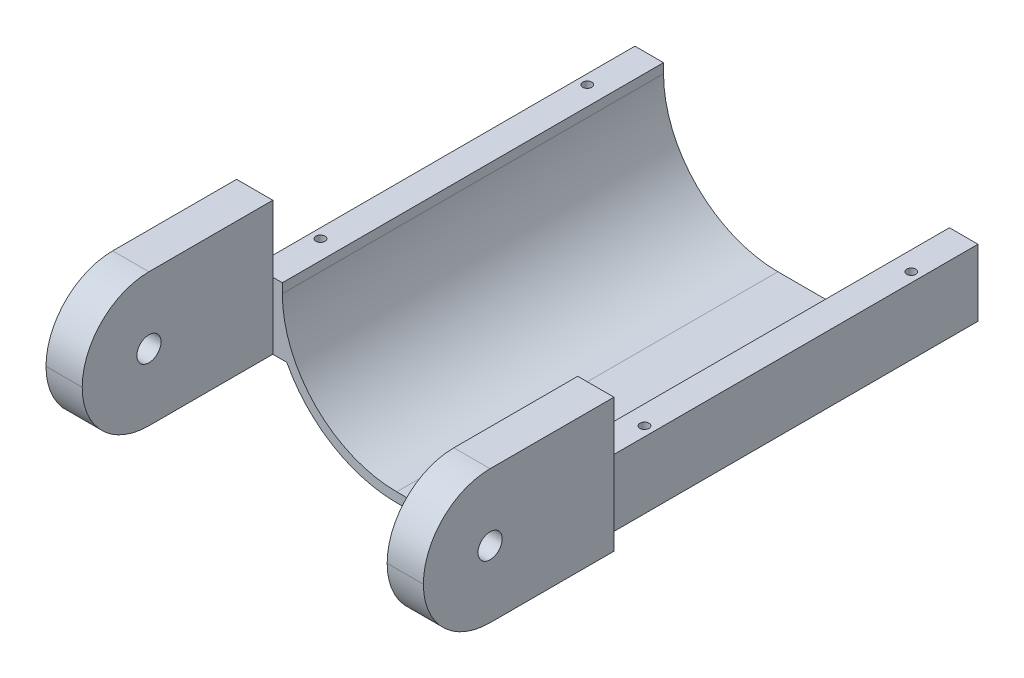
ISO-10303-21;
HEADER;
FILE_DESCRIPTION(('STEP AP214'),'2;1');
FILE_NAME('part.step','',(''),(''),'','','');
FILE_SCHEMA(('AUTOMOTIVE_DESIGN { 1 0 10303 214 1 1 1 1 }'));
ENDSEC;
DATA;
#1=APPLICATION_CONTEXT('core data for automotive mechanical design processes');
#2=APPLICATION_PROTOCOL_DEFINITION('international standard','automotive_design',2000,#1);
#3=PRODUCT_CONTEXT('',#1,'mechanical');
#4=PRODUCT('Part','Part','',(#3));
#5=PRODUCT_RELATED_PRODUCT_CATEGORY('part','',(#4));
#6=PRODUCT_DEFINITION_FORMATION('','',#4);
#7=PRODUCT_DEFINITION_CONTEXT('part definition',#1,'design');
#8=PRODUCT_DEFINITION('design','',#6,#7);
#9=PRODUCT_DEFINITION_SHAPE('','',#8);
#10=(LENGTH_UNIT() NAMED_UNIT(*) SI_UNIT(.MILLI.,.METRE.));
#11=(NAMED_UNIT(*) PLANE_ANGLE_UNIT() SI_UNIT($,.RADIAN.));
#12=(NAMED_UNIT(*) SI_UNIT($,.STERADIAN.) SOLID_ANGLE_UNIT());
#13=UNCERTAINTY_MEASURE_WITH_UNIT(LENGTH_MEASURE(1.E-05),#10,'distance_accuracy_value','');
#14=(GEOMETRIC_REPRESENTATION_CONTEXT(3) GLOBAL_UNCERTAINTY_ASSIGNED_CONTEXT((#13)) GLOBAL_UNIT_ASSIGNED_CONTEXT((#10,
#11,#12)) REPRESENTATION_CONTEXT('',''));
#15=CARTESIAN_POINT('',(0.,0.,0.));
#16=DIRECTION('',(0.,0.,1.));
#17=DIRECTION('',(1.,0.,0.));
#18=AXIS2_PLACEMENT_3D('',#15,#16,#17);
#19=CARTESIAN_POINT('',(0.,0.,300.));
#20=DIRECTION('',(0.,0.,1.));
#21=DIRECTION('',(1.,0.,0.));
#22=AXIS2_PLACEMENT_3D('',#19,#20,#21);
#23=PLANE('',#22);
#24=DIRECTION('',(1.,0.,0.));
#25=VECTOR('',#24,1.);
#26=CARTESIAN_POINT('',(-105.,64.9900000000004,300.));
#27=LINE('',#26,#25);
#28=CARTESIAN_POINT('',(-5.,64.9900000000007,300.));
#29=VERTEX_POINT('',#28);
#30=CARTESIAN_POINT('',(-24.,64.9900000000007,300.));
#31=VERTEX_POINT('',#30);
#32=EDGE_CURVE('E410',#29,#31,#27,.F.);
#33=ORIENTED_EDGE('',*,*,#32,.F.);
#34=DIRECTION('',(0.,-1.,0.));
#35=VECTOR('',#34,1.);
#36=CARTESIAN_POINT('',(-5.,0.,300.));
#37=LINE('',#36,#35);
#38=CARTESIAN_POINT('',(-5.,65.0100000000002,300.));
#39=VERTEX_POINT('',#38);
#40=EDGE_CURVE('E653',#39,#29,#37,.T.);
#41=ORIENTED_EDGE('',*,*,#40,.F.);
#42=DIRECTION('',(1.,0.,0.));
#43=VECTOR('',#42,1.);
#44=CARTESIAN_POINT('',(-105.,65.0100000000004,300.));
#45=LINE('',#44,#43);
#46=CARTESIAN_POINT('',(-24.,65.0100000000004,300.));
#47=VERTEX_POINT('',#46);
#48=EDGE_CURVE('E413',#39,#47,#45,.F.);
#49=ORIENTED_EDGE('',*,*,#48,.T.);
#50=DIRECTION('',(0.,1.,0.));
#51=VECTOR('',#50,1.);
#52=CARTESIAN_POINT('',(-24.,0.,300.));
#53=LINE('',#52,#51);
#54=EDGE_CURVE('E485',#31,#47,#53,.T.);
#55=ORIENTED_EDGE('',*,*,#54,.F.);
#56=EDGE_LOOP('',(#33,#41,#49,#55));
#57=FACE_BOUND('',#56,.T.);
#58=ADVANCED_FACE('F66',(#57),#23,.T.);
#59=CARTESIAN_POINT('',(0.,0.,200.));
#60=DIRECTION('',(0.,0.,1.));
#61=DIRECTION('',(1.,0.,0.));
#62=AXIS2_PLACEMENT_3D('',#59,#60,#61);
#63=PLANE('',#62);
#64=DIRECTION('',(0.,1.,0.));
#65=VECTOR('',#64,1.);
#66=CARTESIAN_POINT('',(-5.,0.,200.));
#67=LINE('',#66,#65);
#68=CARTESIAN_POINT('',(-5.,65.,200.));
#69=VERTEX_POINT('',#68);
#70=CARTESIAN_POINT('',(-5.,100.,200.));
#71=VERTEX_POINT('',#70);
#72=EDGE_CURVE('E247',#69,#71,#67,.T.);
#73=ORIENTED_EDGE('',*,*,#72,.F.);
#74=DIRECTION('',(-1.,0.,0.));
#75=VECTOR('',#74,1.);
#76=CARTESIAN_POINT('',(0.,65.,200.));
#77=LINE('',#76,#75);
#78=CARTESIAN_POINT('',(-15.,65.,200.));
#79=VERTEX_POINT('',#78);
#80=EDGE_CURVE('E330',#69,#79,#77,.T.);
#81=ORIENTED_EDGE('',*,*,#80,.T.);
#82=DIRECTION('',(0.,-1.,0.));
#83=VECTOR('',#82,1.);
#84=CARTESIAN_POINT('',(-15.,0.,200.));
#85=LINE('',#84,#83);
#86=CARTESIAN_POINT('',(-15.,30.0000000000004,200.));
#87=VERTEX_POINT('',#86);
#88=EDGE_CURVE('E12',#79,#87,#85,.T.);
#89=ORIENTED_EDGE('',*,*,#88,.T.);
#90=DIRECTION('',(1.,0.,0.));
#91=VECTOR('',#90,1.);
#92=CARTESIAN_POINT('',(-24.,30.0000000000004,200.));
#93=LINE('',#92,#91);
#94=CARTESIAN_POINT('',(-24.,30.0000000000004,200.));
#95=VERTEX_POINT('',#94);
#96=EDGE_CURVE('E495',#95,#87,#93,.T.);
#97=ORIENTED_EDGE('',*,*,#96,.F.);
#98=DIRECTION('',(0.,-1.,0.));
#99=VECTOR('',#98,1.);
#100=CARTESIAN_POINT('',(-24.,0.,200.));
#101=LINE('',#100,#99);
#102=CARTESIAN_POINT('',(-24.,100.,200.));
#103=VERTEX_POINT('',#102);
#104=EDGE_CURVE('E272',#103,#95,#101,.T.);
#105=ORIENTED_EDGE('',*,*,#104,.F.);
#106=DIRECTION('',(1.,0.,0.));
#107=VECTOR('',#106,1.);
#108=CARTESIAN_POINT('',(0.,100.,200.));
#109=LINE('',#108,#107);
#110=EDGE_CURVE('E262',#103,#71,#109,.T.);
#111=ORIENTED_EDGE('',*,*,#110,.T.);
#112=EDGE_LOOP('',(#73,#81,#89,#97,#105,#111));
#113=FACE_BOUND('',#112,.T.);
#114=ADVANCED_FACE('F269',(#113),#63,.F.);
#115=CARTESIAN_POINT('',(0.,100.,300.));
#116=DIRECTION('',(0.,1.,0.));
#117=DIRECTION('',(0.,0.,1.));
#118=AXIS2_PLACEMENT_3D('',#115,#116,#117);
#119=PLANE('',#118);
#120=DIRECTION('',(1.,0.,0.));
#121=VECTOR('',#120,1.);
#122=CARTESIAN_POINT('',(-105.,100.,265.01));
#123=LINE('',#122,#121);
#124=CARTESIAN_POINT('',(-24.,100.,265.01));
#125=VERTEX_POINT('',#124);
#126=CARTESIAN_POINT('',(-5.,100.,265.01));
#127=VERTEX_POINT('',#126);
#128=EDGE_CURVE('E264',#125,#127,#123,.T.);
#129=ORIENTED_EDGE('',*,*,#128,.T.);
#130=DIRECTION('',(0.,0.,1.));
#131=VECTOR('',#130,1.);
#132=CARTESIAN_POINT('',(-5.,100.,0.));
#133=LINE('',#132,#131);
#134=EDGE_CURVE('E84',#71,#127,#133,.T.);
#135=ORIENTED_EDGE('',*,*,#134,.F.);
#136=ORIENTED_EDGE('',*,*,#110,.F.);
#137=DIRECTION('',(0.,0.,-1.));
#138=VECTOR('',#137,1.);
#139=CARTESIAN_POINT('',(-24.,100.,0.));
#140=LINE('',#139,#138);
#141=EDGE_CURVE('E493',#125,#103,#140,.T.);
#142=ORIENTED_EDGE('',*,*,#141,.F.);
#143=EDGE_LOOP('',(#129,#135,#136,#142));
#144=FACE_BOUND('',#143,.T.);
#145=ADVANCED_FACE('F260',(#144),#119,.T.);
#146=CARTESIAN_POINT('',(-105.,64.9900000000004,265.01));
#147=DIRECTION('',(1.,0.,0.));
#148=DIRECTION('',(0.,1.,0.));
#149=AXIS2_PLACEMENT_3D('',#146,#147,#148);
#150=CYLINDRICAL_SURFACE('',#149,34.99);
#151=CARTESIAN_POINT('',(-5.,64.9900000000004,265.01));
#152=DIRECTION('',(1.,0.,0.));
#153=DIRECTION('',(0.,0.,-1.));
#154=AXIS2_PLACEMENT_3D('',#151,#152,#153);
#155=CIRCLE('',#154,34.99);
#156=CARTESIAN_POINT('',(-5.,30.0000000000004,265.01));
#157=VERTEX_POINT('',#156);
#158=EDGE_CURVE('E649',#29,#157,#155,.T.);
#159=ORIENTED_EDGE('',*,*,#158,.F.);
#160=ORIENTED_EDGE('',*,*,#32,.T.);
#161=CARTESIAN_POINT('',(-24.,64.9900000000004,265.01));
#162=DIRECTION('',(-1.,0.,0.));
#163=DIRECTION('',(0.,0.,1.));
#164=AXIS2_PLACEMENT_3D('',#161,#162,#163);
#165=CIRCLE('',#164,34.99);
#166=CARTESIAN_POINT('',(-24.,30.0000000000004,265.01));
#167=VERTEX_POINT('',#166);
#168=EDGE_CURVE('E481',#167,#31,#165,.T.);
#169=ORIENTED_EDGE('',*,*,#168,.F.);
#170=DIRECTION('',(1.,0.,0.));
#171=VECTOR('',#170,1.);
#172=CARTESIAN_POINT('',(-105.,30.0000000000004,265.01));
#173=LINE('',#172,#171);
#174=EDGE_CURVE('E275',#167,#157,#173,.T.);
#175=ORIENTED_EDGE('',*,*,#174,.T.);
#176=EDGE_LOOP('',(#159,#160,#169,#175));
#177=FACE_BOUND('',#176,.T.);
#178=ADVANCED_FACE('F670',(#177),#150,.T.);
#179=CARTESIAN_POINT('',(-105.,65.0100000000004,265.01));
#180=DIRECTION('',(1.,0.,0.));
#181=DIRECTION('',(0.,1.,0.));
#182=AXIS2_PLACEMENT_3D('',#179,#180,#181);
#183=CYLINDRICAL_SURFACE('',#182,34.99);
#184=CARTESIAN_POINT('',(-5.,65.0100000000004,265.01));
#185=DIRECTION('',(1.,0.,0.));
#186=DIRECTION('',(0.,0.,-1.));
#187=AXIS2_PLACEMENT_3D('',#184,#185,#186);
#188=CIRCLE('',#187,34.99);
#189=EDGE_CURVE('E266',#127,#39,#188,.T.);
#190=ORIENTED_EDGE('',*,*,#189,.F.);
#191=ORIENTED_EDGE('',*,*,#128,.F.);
#192=CARTESIAN_POINT('',(-24.,65.0100000000004,265.01));
#193=DIRECTION('',(-1.,0.,0.));
#194=DIRECTION('',(0.,0.,1.));
#195=AXIS2_PLACEMENT_3D('',#192,#193,#194);
#196=CIRCLE('',#195,34.99);
#197=EDGE_CURVE('E489',#47,#125,#196,.T.);
#198=ORIENTED_EDGE('',*,*,#197,.F.);
#199=ORIENTED_EDGE('',*,*,#48,.F.);
#200=EDGE_LOOP('',(#190,#191,#198,#199));
#201=FACE_BOUND('',#200,.T.);
#202=ADVANCED_FACE('F665',(#201),#183,.T.);
#203=CARTESIAN_POINT('',(-105.,65.0000000000004,265.));
#204=DIRECTION('',(1.,0.,0.));
#205=DIRECTION('',(0.,1.,0.));
#206=AXIS2_PLACEMENT_3D('',#203,#204,#205);
#207=CYLINDRICAL_SURFACE('',#206,6.35);
#208=CARTESIAN_POINT('',(-24.,65.0000000000004,265.));
#209=DIRECTION('',(-1.,0.,0.));
#210=DIRECTION('',(0.,0.,1.));
#211=AXIS2_PLACEMENT_3D('',#208,#209,#210);
#212=CIRCLE('',#211,6.35);
#213=CARTESIAN_POINT('',(-24.,65.0000000000004,271.35));
#214=VERTEX_POINT('',#213);
#215=EDGE_CURVE('E467',#214,#214,#212,.F.);
#216=ORIENTED_EDGE('',*,*,#215,.F.);
#217=EDGE_LOOP('',(#216));
#218=FACE_BOUND('',#217,.T.);
#219=CARTESIAN_POINT('',(-5.,65.0000000000004,265.));
#220=DIRECTION('',(1.,0.,0.));
#221=DIRECTION('',(0.,0.,-1.));
#222=AXIS2_PLACEMENT_3D('',#219,#220,#221);
#223=CIRCLE('',#222,6.34999999999999);
#224=CARTESIAN_POINT('',(-5.,65.0000000000004,258.65));
#225=VERTEX_POINT('',#224);
#226=EDGE_CURVE('E256',#225,#225,#223,.F.);
#227=ORIENTED_EDGE('',*,*,#226,.F.);
#228=EDGE_LOOP('',(#227));
#229=FACE_BOUND('',#228,.T.);
#230=ADVANCED_FACE('F707',(#218,#229),#207,.F.);
#231=CARTESIAN_POINT('',(150.,0.,200.));
#232=DIRECTION('',(-1.,0.,0.));
#233=DIRECTION('',(0.,0.,1.));
#234=AXIS2_PLACEMENT_3D('',#231,#232,#233);
#235=PLANE('',#234);
#236=DIRECTION('',(0.,0.,-1.));
#237=VECTOR('',#236,1.);
#238=CARTESIAN_POINT('',(150.,60.0000000000004,200.));
#239=LINE('',#238,#237);
#240=CARTESIAN_POINT('',(150.,60.,200.));
#241=VERTEX_POINT('',#240);
#242=CARTESIAN_POINT('',(150.,60.0000000000004,0.));
#243=VERTEX_POINT('',#242);
#244=EDGE_CURVE('E394',#241,#243,#239,.T.);
#245=ORIENTED_EDGE('',*,*,#244,.F.);
#246=DIRECTION('',(0.,1.,0.));
#247=VECTOR('',#246,1.);
#248=CARTESIAN_POINT('',(150.,0.,200.));
#249=LINE('',#248,#247);
#250=CARTESIAN_POINT('',(150.,65.,200.));
#251=VERTEX_POINT('',#250);
#252=EDGE_CURVE('E468',#241,#251,#249,.T.);
#253=ORIENTED_EDGE('',*,*,#252,.T.);
#254=DIRECTION('',(0.,0.,-1.));
#255=VECTOR('',#254,1.);
#256=CARTESIAN_POINT('',(150.,65.,200.));
#257=LINE('',#256,#255);
#258=CARTESIAN_POINT('',(150.,65.,0.));
#259=VERTEX_POINT('',#258);
#260=EDGE_CURVE('E397',#251,#259,#257,.T.);
#261=ORIENTED_EDGE('',*,*,#260,.T.);
#262=DIRECTION('',(0.,1.,0.));
#263=VECTOR('',#262,1.);
#264=CARTESIAN_POINT('',(150.,0.,0.));
#265=LINE('',#264,#263);
#266=EDGE_CURVE('E357',#243,#259,#265,.T.);
#267=ORIENTED_EDGE('',*,*,#266,.F.);
#268=EDGE_LOOP('',(#245,#253,#261,#267));
#269=FACE_BOUND('',#268,.T.);
#270=ADVANCED_FACE('F620',(#269),#235,.T.);
#271=CARTESIAN_POINT('',(150.,65.,200.));
#272=DIRECTION('',(0.,0.,-1.));
#273=DIRECTION('',(-1.,0.,0.));
#274=AXIS2_PLACEMENT_3D('',#271,#272,#273);
#275=PLANE('',#274);
#276=DIRECTION('',(1.,0.,0.));
#277=VECTOR('',#276,1.);
#278=CARTESIAN_POINT('',(0.,65.,200.));
#279=LINE('',#278,#277);
#280=CARTESIAN_POINT('',(155.,65.,200.));
#281=VERTEX_POINT('',#280);
#282=CARTESIAN_POINT('',(165.,65.,200.));
#283=VERTEX_POINT('',#282);
#284=EDGE_CURVE('E313',#281,#283,#279,.T.);
#285=ORIENTED_EDGE('',*,*,#284,.F.);
#286=DIRECTION('',(0.,1.,0.));
#287=VECTOR('',#286,1.);
#288=CARTESIAN_POINT('',(155.,0.,200.));
#289=LINE('',#288,#287);
#290=CARTESIAN_POINT('',(155.,100.,200.));
#291=VERTEX_POINT('',#290);
#292=EDGE_CURVE('E449',#281,#291,#289,.T.);
#293=ORIENTED_EDGE('',*,*,#292,.T.);
#294=DIRECTION('',(1.,0.,0.));
#295=VECTOR('',#294,1.);
#296=CARTESIAN_POINT('',(150.,100.,200.));
#297=LINE('',#296,#295);
#298=CARTESIAN_POINT('',(174.,100.,200.));
#299=VERTEX_POINT('',#298);
#300=EDGE_CURVE('E561',#291,#299,#297,.T.);
#301=ORIENTED_EDGE('',*,*,#300,.T.);
#302=DIRECTION('',(0.,-1.,0.));
#303=VECTOR('',#302,1.);
#304=CARTESIAN_POINT('',(174.,0.,200.));
#305=LINE('',#304,#303);
#306=CARTESIAN_POINT('',(174.,30.0000000000004,200.));
#307=VERTEX_POINT('',#306);
#308=EDGE_CURVE('E500',#299,#307,#305,.T.);
#309=ORIENTED_EDGE('',*,*,#308,.T.);
#310=DIRECTION('',(-1.,0.,0.));
#311=VECTOR('',#310,1.);
#312=CARTESIAN_POINT('',(174.,30.0000000000004,200.));
#313=LINE('',#312,#311);
#314=CARTESIAN_POINT('',(165.,30.0000000000004,200.));
#315=VERTEX_POINT('',#314);
#316=EDGE_CURVE('E527',#307,#315,#313,.T.);
#317=ORIENTED_EDGE('',*,*,#316,.T.);
#318=DIRECTION('',(0.,-1.,0.));
#319=VECTOR('',#318,1.);
#320=CARTESIAN_POINT('',(165.,0.,200.));
#321=LINE('',#320,#319);
#322=EDGE_CURVE('E76',#283,#315,#321,.T.);
#323=ORIENTED_EDGE('',*,*,#322,.F.);
#324=EDGE_LOOP('',(#285,#293,#301,#309,#317,#323));
#325=FACE_BOUND('',#324,.T.);
#326=ADVANCED_FACE('F600',(#325),#275,.T.);
#327=CARTESIAN_POINT('',(150.,65.0100000000004,265.01));
#328=DIRECTION('',(1.,0.,0.));
#329=DIRECTION('',(0.,0.,-1.));
#330=AXIS2_PLACEMENT_3D('',#327,#328,#329);
#331=CYLINDRICAL_SURFACE('',#330,34.99);
#332=DIRECTION('',(1.,0.,0.));
#333=VECTOR('',#332,1.);
#334=CARTESIAN_POINT('',(150.,100.,265.01));
#335=LINE('',#334,#333);
#336=CARTESIAN_POINT('',(155.,100.,265.01));
#337=VERTEX_POINT('',#336);
#338=CARTESIAN_POINT('',(174.,100.,265.01));
#339=VERTEX_POINT('',#338);
#340=EDGE_CURVE('E558',#337,#339,#335,.T.);
#341=ORIENTED_EDGE('',*,*,#340,.F.);
#342=CARTESIAN_POINT('',(155.,65.0100000000004,265.01));
#343=DIRECTION('',(-1.,0.,0.));
#344=DIRECTION('',(0.,0.,1.));
#345=AXIS2_PLACEMENT_3D('',#342,#343,#344);
#346=CIRCLE('',#345,34.99);
#347=CARTESIAN_POINT('',(155.,65.0100000000004,300.));
#348=VERTEX_POINT('',#347);
#349=EDGE_CURVE('E457',#348,#337,#346,.T.);
#350=ORIENTED_EDGE('',*,*,#349,.F.);
#351=DIRECTION('',(1.,0.,0.));
#352=VECTOR('',#351,1.);
#353=CARTESIAN_POINT('',(150.,65.0100000000002,300.));
#354=LINE('',#353,#352);
#355=CARTESIAN_POINT('',(174.,65.0100000000002,300.));
#356=VERTEX_POINT('',#355);
#357=EDGE_CURVE('E557',#348,#356,#354,.T.);
#358=ORIENTED_EDGE('',*,*,#357,.T.);
#359=CARTESIAN_POINT('',(174.,65.0100000000004,265.01));
#360=DIRECTION('',(1.,0.,0.));
#361=DIRECTION('',(0.,0.,-1.));
#362=AXIS2_PLACEMENT_3D('',#359,#360,#361);
#363=CIRCLE('',#362,34.99);
#364=EDGE_CURVE('E508',#339,#356,#363,.T.);
#365=ORIENTED_EDGE('',*,*,#364,.F.);
#366=EDGE_LOOP('',(#341,#350,#358,#365));
#367=FACE_BOUND('',#366,.T.);
#368=ADVANCED_FACE('F576',(#367),#331,.T.);
#369=CARTESIAN_POINT('',(150.,100.,200.));
#370=DIRECTION('',(0.,1.,0.));
#371=DIRECTION('',(0.,0.,1.));
#372=AXIS2_PLACEMENT_3D('',#369,#370,#371);
#373=PLANE('',#372);
#374=ORIENTED_EDGE('',*,*,#300,.F.);
#375=DIRECTION('',(0.,0.,-1.));
#376=VECTOR('',#375,1.);
#377=CARTESIAN_POINT('',(155.,100.,0.));
#378=LINE('',#377,#376);
#379=EDGE_CURVE('E460',#337,#291,#378,.T.);
#380=ORIENTED_EDGE('',*,*,#379,.F.);
#381=ORIENTED_EDGE('',*,*,#340,.T.);
#382=DIRECTION('',(0.,0.,1.));
#383=VECTOR('',#382,1.);
#384=CARTESIAN_POINT('',(174.,100.,0.));
#385=LINE('',#384,#383);
#386=EDGE_CURVE('E504',#299,#339,#385,.T.);
#387=ORIENTED_EDGE('',*,*,#386,.F.);
#388=EDGE_LOOP('',(#374,#380,#381,#387));
#389=FACE_BOUND('',#388,.T.);
#390=ADVANCED_FACE('F605',(#389),#373,.T.);
#391=CARTESIAN_POINT('',(150.,30.0000000000004,265.01));
#392=DIRECTION('',(0.,-1.,0.));
#393=DIRECTION('',(0.,0.,-1.));
#394=AXIS2_PLACEMENT_3D('',#391,#392,#393);
#395=PLANE('',#394);
#396=CARTESIAN_POINT('',(159.999999999999,30.0000000000004,170.));
#397=DIRECTION('',(0.,-1.,0.));
#398=DIRECTION('',(0.,0.,-1.));
#399=AXIS2_PLACEMENT_3D('',#396,#397,#398);
#400=CIRCLE('',#399,2.38125);
#401=CARTESIAN_POINT('',(159.999999999999,30.0000000000004,167.61875));
#402=VERTEX_POINT('',#401);
#403=EDGE_CURVE('E70',#402,#402,#400,.T.);
#404=ORIENTED_EDGE('',*,*,#403,.F.);
#405=EDGE_LOOP('',(#404));
#406=FACE_BOUND('',#405,.T.);
#407=CARTESIAN_POINT('',(159.999999999999,30.0000000000004,30.));
#408=DIRECTION('',(0.,-1.,0.));
#409=DIRECTION('',(0.,0.,-1.));
#410=AXIS2_PLACEMENT_3D('',#407,#408,#409);
#411=CIRCLE('',#410,2.38125000000001);
#412=CARTESIAN_POINT('',(159.999999999999,30.0000000000004,27.61875));
#413=VERTEX_POINT('',#412);
#414=EDGE_CURVE('E423',#413,#413,#411,.T.);
#415=ORIENTED_EDGE('',*,*,#414,.F.);
#416=EDGE_LOOP('',(#415));
#417=FACE_BOUND('',#416,.T.);
#418=DIRECTION('',(0.,0.,1.));
#419=VECTOR('',#418,1.);
#420=CARTESIAN_POINT('',(155.,30.0000000000004,0.));
#421=LINE('',#420,#419);
#422=CARTESIAN_POINT('',(155.,30.0000000000004,200.));
#423=VERTEX_POINT('',#422);
#424=CARTESIAN_POINT('',(155.,30.0000000000004,265.01));
#425=VERTEX_POINT('',#424);
#426=EDGE_CURVE('E448',#423,#425,#421,.T.);
#427=ORIENTED_EDGE('',*,*,#426,.F.);
#428=DIRECTION('',(-1.,0.,0.));
#429=VECTOR('',#428,1.);
#430=CARTESIAN_POINT('',(0.,30.0000000000004,200.));
#431=LINE('',#430,#429);
#432=CARTESIAN_POINT('',(147.662812973354,30.0000000000004,200.));
#433=VERTEX_POINT('',#432);
#434=EDGE_CURVE('E545',#423,#433,#431,.T.);
#435=ORIENTED_EDGE('',*,*,#434,.T.);
#436=DIRECTION('',(0.,0.,-1.));
#437=VECTOR('',#436,1.);
#438=CARTESIAN_POINT('',(147.662812973354,30.0000000000004,200.));
#439=LINE('',#438,#437);
#440=CARTESIAN_POINT('',(147.662812973354,30.0000000000004,0.));
#441=VERTEX_POINT('',#440);
#442=EDGE_CURVE('E548',#433,#441,#439,.T.);
#443=ORIENTED_EDGE('',*,*,#442,.T.);
#444=DIRECTION('',(-1.,0.,0.));
#445=VECTOR('',#444,1.);
#446=CARTESIAN_POINT('',(0.,30.0000000000004,0.));
#447=LINE('',#446,#445);
#448=CARTESIAN_POINT('',(165.,30.0000000000004,0.));
#449=VERTEX_POINT('',#448);
#450=EDGE_CURVE('E544',#449,#441,#447,.T.);
#451=ORIENTED_EDGE('',*,*,#450,.F.);
#452=DIRECTION('',(0.,0.,-1.));
#453=VECTOR('',#452,1.);
#454=CARTESIAN_POINT('',(165.,30.0000000000004,265.01));
#455=LINE('',#454,#453);
#456=EDGE_CURVE('E554',#315,#449,#455,.T.);
#457=ORIENTED_EDGE('',*,*,#456,.F.);
#458=ORIENTED_EDGE('',*,*,#316,.F.);
#459=DIRECTION('',(0.,0.,-1.));
#460=VECTOR('',#459,1.);
#461=CARTESIAN_POINT('',(174.,30.0000000000004,0.));
#462=LINE('',#461,#460);
#463=CARTESIAN_POINT('',(174.,30.0000000000004,265.01));
#464=VERTEX_POINT('',#463);
#465=EDGE_CURVE('E520',#464,#307,#462,.T.);
#466=ORIENTED_EDGE('',*,*,#465,.F.);
#467=DIRECTION('',(1.,0.,0.));
#468=VECTOR('',#467,1.);
#469=CARTESIAN_POINT('',(150.,30.0000000000004,265.01));
#470=LINE('',#469,#468);
#471=EDGE_CURVE('E564',#425,#464,#470,.T.);
#472=ORIENTED_EDGE('',*,*,#471,.F.);
#473=EDGE_LOOP('',(#427,#435,#443,#451,#457,#458,#466,#472));
#474=FACE_BOUND('',#473,.T.);
#475=ADVANCED_FACE('F594',(#406,#417,#474),#395,.T.);
#476=CARTESIAN_POINT('',(150.,64.9900000000004,265.01));
#477=DIRECTION('',(1.,0.,0.));
#478=DIRECTION('',(0.,0.,-1.));
#479=AXIS2_PLACEMENT_3D('',#476,#477,#478);
#480=CYLINDRICAL_SURFACE('',#479,34.99);
#481=DIRECTION('',(1.,0.,0.));
#482=VECTOR('',#481,1.);
#483=CARTESIAN_POINT('',(150.,64.9900000000007,300.));
#484=LINE('',#483,#482);
#485=CARTESIAN_POINT('',(155.,64.9900000000007,300.));
#486=VERTEX_POINT('',#485);
#487=CARTESIAN_POINT('',(174.,64.9900000000007,300.));
#488=VERTEX_POINT('',#487);
#489=EDGE_CURVE('E567',#486,#488,#484,.T.);
#490=ORIENTED_EDGE('',*,*,#489,.F.);
#491=CARTESIAN_POINT('',(155.,64.9900000000004,265.01));
#492=DIRECTION('',(-1.,0.,0.));
#493=DIRECTION('',(0.,0.,1.));
#494=AXIS2_PLACEMENT_3D('',#491,#492,#493);
#495=CIRCLE('',#494,34.99);
#496=EDGE_CURVE('E92',#425,#486,#495,.T.);
#497=ORIENTED_EDGE('',*,*,#496,.F.);
#498=ORIENTED_EDGE('',*,*,#471,.T.);
#499=CARTESIAN_POINT('',(174.,64.9900000000004,265.01));
#500=DIRECTION('',(1.,0.,0.));
#501=DIRECTION('',(0.,0.,-1.));
#502=AXIS2_PLACEMENT_3D('',#499,#500,#501);
#503=CIRCLE('',#502,34.99);
#504=EDGE_CURVE('E516',#488,#464,#503,.T.);
#505=ORIENTED_EDGE('',*,*,#504,.F.);
#506=EDGE_LOOP('',(#490,#497,#498,#505));
#507=FACE_BOUND('',#506,.T.);
#508=ADVANCED_FACE('F588',(#507),#480,.T.);
#509=CARTESIAN_POINT('',(150.,65.0100000000002,300.));
#510=DIRECTION('',(0.,0.,1.));
#511=DIRECTION('',(1.,0.,0.));
#512=AXIS2_PLACEMENT_3D('',#509,#510,#511);
#513=PLANE('',#512);
#514=ORIENTED_EDGE('',*,*,#357,.F.);
#515=DIRECTION('',(0.,1.,0.));
#516=VECTOR('',#515,1.);
#517=CARTESIAN_POINT('',(155.,0.,300.));
#518=LINE('',#517,#516);
#519=EDGE_CURVE('E454',#486,#348,#518,.T.);
#520=ORIENTED_EDGE('',*,*,#519,.F.);
#521=ORIENTED_EDGE('',*,*,#489,.T.);
#522=DIRECTION('',(0.,-1.,0.));
#523=VECTOR('',#522,1.);
#524=CARTESIAN_POINT('',(174.,0.,300.));
#525=LINE('',#524,#523);
#526=EDGE_CURVE('E512',#356,#488,#525,.T.);
#527=ORIENTED_EDGE('',*,*,#526,.F.);
#528=EDGE_LOOP('',(#514,#520,#521,#527));
#529=FACE_BOUND('',#528,.T.);
#530=ADVANCED_FACE('F585',(#529),#513,.T.);
#531=CARTESIAN_POINT('',(150.,65.0000000000004,265.));
#532=DIRECTION('',(1.,0.,0.));
#533=DIRECTION('',(0.,0.,-1.));
#534=AXIS2_PLACEMENT_3D('',#531,#532,#533);
#535=CYLINDRICAL_SURFACE('',#534,6.34999999999999);
#536=CARTESIAN_POINT('',(174.,65.0000000000004,265.));
#537=DIRECTION('',(1.,0.,0.));
#538=DIRECTION('',(0.,0.,-1.));
#539=AXIS2_PLACEMENT_3D('',#536,#537,#538);
#540=CIRCLE('',#539,6.34999999999999);
#541=CARTESIAN_POINT('',(174.,65.0000000000004,258.65));
#542=VERTEX_POINT('',#541);
#543=EDGE_CURVE('E523',#542,#542,#540,.F.);
#544=ORIENTED_EDGE('',*,*,#543,.F.);
#545=EDGE_LOOP('',(#544));
#546=FACE_BOUND('',#545,.T.);
#547=CARTESIAN_POINT('',(155.,65.0000000000004,265.));
#548=DIRECTION('',(-1.,0.,0.));
#549=DIRECTION('',(0.,0.,1.));
#550=AXIS2_PLACEMENT_3D('',#547,#548,#549);
#551=CIRCLE('',#550,6.34999999999999);
#552=CARTESIAN_POINT('',(155.,65.0000000000004,271.35));
#553=VERTEX_POINT('',#552);
#554=EDGE_CURVE('E463',#553,#553,#551,.F.);
#555=ORIENTED_EDGE('',*,*,#554,.F.);
#556=EDGE_LOOP('',(#555));
#557=FACE_BOUND('',#556,.T.);
#558=ADVANCED_FACE('F733',(#546,#557),#535,.F.);
#559=CARTESIAN_POINT('',(0.,0.,200.));
#560=DIRECTION('',(0.,0.,1.));
#561=DIRECTION('',(1.,0.,0.));
#562=AXIS2_PLACEMENT_3D('',#559,#560,#561);
#563=PLANE('',#562);
#564=CARTESIAN_POINT('',(60.,60.,200.));
#565=DIRECTION('',(0.,0.,1.));
#566=DIRECTION('',(1.,0.,0.));
#567=AXIS2_PLACEMENT_3D('',#564,#565,#566);
#568=CIRCLE('',#567,60.);
#569=CARTESIAN_POINT('',(60.0000000000004,0.,200.));
#570=VERTEX_POINT('',#569);
#571=CARTESIAN_POINT('',(0.,60.0000000000004,200.));
#572=VERTEX_POINT('',#571);
#573=EDGE_CURVE('E326',#570,#572,#568,.F.);
#574=ORIENTED_EDGE('',*,*,#573,.T.);
#575=DIRECTION('',(0.,1.,0.));
#576=VECTOR('',#575,1.);
#577=CARTESIAN_POINT('',(0.,0.,200.));
#578=LINE('',#577,#576);
#579=CARTESIAN_POINT('',(0.,65.,200.));
#580=VERTEX_POINT('',#579);
#581=EDGE_CURVE('E430',#572,#580,#578,.T.);
#582=ORIENTED_EDGE('',*,*,#581,.T.);
#583=EDGE_CURVE('E331',#580,#69,#77,.T.);
#584=ORIENTED_EDGE('',*,*,#583,.T.);
#585=CARTESIAN_POINT('',(-5.,30.0000000000004,200.));
#586=VERTEX_POINT('',#585);
#587=EDGE_CURVE('E251',#586,#69,#67,.T.);
#588=ORIENTED_EDGE('',*,*,#587,.F.);
#589=DIRECTION('',(-1.,0.,0.));
#590=VECTOR('',#589,1.);
#591=CARTESIAN_POINT('',(0.,30.0000000000004,200.));
#592=LINE('',#591,#590);
#593=CARTESIAN_POINT('',(2.33718702664579,30.0000000000004,200.));
#594=VERTEX_POINT('',#593);
#595=EDGE_CURVE('E534',#594,#586,#592,.T.);
#596=ORIENTED_EDGE('',*,*,#595,.F.);
#597=CARTESIAN_POINT('',(60.,60.,200.));
#598=DIRECTION('',(0.,0.,1.));
#599=DIRECTION('',(1.,0.,0.));
#600=AXIS2_PLACEMENT_3D('',#597,#598,#599);
#601=CIRCLE('',#600,65.);
#602=CARTESIAN_POINT('',(60.0000000000004,-5.,200.));
#603=VERTEX_POINT('',#602);
#604=EDGE_CURVE('E301',#603,#594,#601,.F.);
#605=ORIENTED_EDGE('',*,*,#604,.F.);
#606=DIRECTION('',(1.,0.,0.));
#607=VECTOR('',#606,1.);
#608=CARTESIAN_POINT('',(0.,-5.00000000000001,200.));
#609=LINE('',#608,#607);
#610=CARTESIAN_POINT('',(89.9999999999996,-5.,200.));
#611=VERTEX_POINT('',#610);
#612=EDGE_CURVE('E305',#603,#611,#609,.T.);
#613=ORIENTED_EDGE('',*,*,#612,.T.);
#614=CARTESIAN_POINT('',(90.,60.,200.));
#615=DIRECTION('',(0.,0.,1.));
#616=DIRECTION('',(1.,0.,0.));
#617=AXIS2_PLACEMENT_3D('',#614,#615,#616);
#618=CIRCLE('',#617,65.);
#619=EDGE_CURVE('E309',#611,#433,#618,.T.);
#620=ORIENTED_EDGE('',*,*,#619,.T.);
#621=ORIENTED_EDGE('',*,*,#434,.F.);
#622=EDGE_CURVE('E444',#423,#281,#289,.T.);
#623=ORIENTED_EDGE('',*,*,#622,.T.);
#624=EDGE_CURVE('E314',#251,#281,#279,.T.);
#625=ORIENTED_EDGE('',*,*,#624,.F.);
#626=ORIENTED_EDGE('',*,*,#252,.F.);
#627=CARTESIAN_POINT('',(90.,60.,200.));
#628=DIRECTION('',(0.,0.,1.));
#629=DIRECTION('',(1.,0.,0.));
#630=AXIS2_PLACEMENT_3D('',#627,#628,#629);
#631=CIRCLE('',#630,60.);
#632=CARTESIAN_POINT('',(89.9999999999996,0.,200.));
#633=VERTEX_POINT('',#632);
#634=EDGE_CURVE('E318',#633,#241,#631,.T.);
#635=ORIENTED_EDGE('',*,*,#634,.F.);
#636=DIRECTION('',(1.,0.,0.));
#637=VECTOR('',#636,1.);
#638=CARTESIAN_POINT('',(0.,0.,200.));
#639=LINE('',#638,#637);
#640=EDGE_CURVE('E322',#570,#633,#639,.T.);
#641=ORIENTED_EDGE('',*,*,#640,.F.);
#642=EDGE_LOOP('',(#574,#582,#584,#588,#596,#605,#613,#620,#621,#623,#625,#626,#635,#641));
#643=FACE_BOUND('',#642,.T.);
#644=ADVANCED_FACE('F610',(#643),#563,.T.);
#645=CARTESIAN_POINT('',(-15.,0.,200.));
#646=DIRECTION('',(-1.,0.,0.));
#647=DIRECTION('',(0.,0.,1.));
#648=AXIS2_PLACEMENT_3D('',#645,#646,#647);
#649=PLANE('',#648);
#650=ORIENTED_EDGE('',*,*,#88,.F.);
#651=DIRECTION('',(0.,0.,-1.));
#652=VECTOR('',#651,1.);
#653=CARTESIAN_POINT('',(-15.,65.,200.));
#654=LINE('',#653,#652);
#655=CARTESIAN_POINT('',(-15.,65.,0.));
#656=VERTEX_POINT('',#655);
#657=EDGE_CURVE('E334',#79,#656,#654,.T.);
#658=ORIENTED_EDGE('',*,*,#657,.T.);
#659=DIRECTION('',(0.,1.,0.));
#660=VECTOR('',#659,1.);
#661=CARTESIAN_POINT('',(-15.,0.,0.));
#662=LINE('',#661,#660);
#663=CARTESIAN_POINT('',(-15.,30.0000000000004,0.));
#664=VERTEX_POINT('',#663);
#665=EDGE_CURVE('E300',#664,#656,#662,.T.);
#666=ORIENTED_EDGE('',*,*,#665,.F.);
#667=DIRECTION('',(0.,0.,-1.));
#668=VECTOR('',#667,1.);
#669=CARTESIAN_POINT('',(-15.,30.0000000000004,300.));
#670=LINE('',#669,#668);
#671=EDGE_CURVE('E274',#87,#664,#670,.T.);
#672=ORIENTED_EDGE('',*,*,#671,.F.);
#673=EDGE_LOOP('',(#650,#658,#666,#672));
#674=FACE_BOUND('',#673,.T.);
#675=ADVANCED_FACE('F68',(#674),#649,.T.);
#676=CARTESIAN_POINT('',(60.,60.,200.));
#677=DIRECTION('',(0.,0.,-1.));
#678=DIRECTION('',(-1.,0.,0.));
#679=AXIS2_PLACEMENT_3D('',#676,#677,#678);
#680=CYLINDRICAL_SURFACE('',#679,65.);
#681=DIRECTION('',(0.,0.,-1.));
#682=VECTOR('',#681,1.);
#683=CARTESIAN_POINT('',(2.33718702664579,30.0000000000004,200.));
#684=LINE('',#683,#682);
#685=CARTESIAN_POINT('',(2.33718702664579,30.0000000000004,0.));
#686=VERTEX_POINT('',#685);
#687=EDGE_CURVE('E537',#594,#686,#684,.T.);
#688=ORIENTED_EDGE('',*,*,#687,.T.);
#689=CARTESIAN_POINT('',(60.,60.,0.));
#690=DIRECTION('',(0.,0.,1.));
#691=DIRECTION('',(1.,0.,0.));
#692=AXIS2_PLACEMENT_3D('',#689,#690,#691);
#693=CIRCLE('',#692,65.);
#694=CARTESIAN_POINT('',(60.0000000000004,-5.,0.));
#695=VERTEX_POINT('',#694);
#696=EDGE_CURVE('E338',#695,#686,#693,.F.);
#697=ORIENTED_EDGE('',*,*,#696,.F.);
#698=DIRECTION('',(0.,0.,-1.));
#699=VECTOR('',#698,1.);
#700=CARTESIAN_POINT('',(60.0000000000004,-5.,200.));
#701=LINE('',#700,#699);
#702=EDGE_CURVE('E407',#603,#695,#701,.T.);
#703=ORIENTED_EDGE('',*,*,#702,.F.);
#704=ORIENTED_EDGE('',*,*,#604,.T.);
#705=EDGE_LOOP('',(#688,#697,#703,#704));
#706=FACE_BOUND('',#705,.T.);
#707=ADVANCED_FACE('F676',(#706),#680,.T.);
#708=CARTESIAN_POINT('',(0.,-5.00000000000001,200.));
#709=DIRECTION('',(0.,1.,0.));
#710=DIRECTION('',(-1.,0.,0.));
#711=AXIS2_PLACEMENT_3D('',#708,#709,#710);
#712=PLANE('',#711);
#713=DIRECTION('',(1.,0.,0.));
#714=VECTOR('',#713,1.);
#715=CARTESIAN_POINT('',(0.,-5.00000000000001,0.));
#716=LINE('',#715,#714);
#717=CARTESIAN_POINT('',(89.9999999999996,-5.,0.));
#718=VERTEX_POINT('',#717);
#719=EDGE_CURVE('E342',#695,#718,#716,.T.);
#720=ORIENTED_EDGE('',*,*,#719,.T.);
#721=DIRECTION('',(0.,0.,-1.));
#722=VECTOR('',#721,1.);
#723=CARTESIAN_POINT('',(89.9999999999996,-5.,200.));
#724=LINE('',#723,#722);
#725=EDGE_CURVE('E403',#611,#718,#724,.T.);
#726=ORIENTED_EDGE('',*,*,#725,.F.);
#727=ORIENTED_EDGE('',*,*,#612,.F.);
#728=ORIENTED_EDGE('',*,*,#702,.T.);
#729=EDGE_LOOP('',(#720,#726,#727,#728));
#730=FACE_BOUND('',#729,.T.);
#731=ADVANCED_FACE('F681',(#730),#712,.F.);
#732=CARTESIAN_POINT('',(90.,60.,200.));
#733=DIRECTION('',(0.,0.,-1.));
#734=DIRECTION('',(-1.,0.,0.));
#735=AXIS2_PLACEMENT_3D('',#732,#733,#734);
#736=CYLINDRICAL_SURFACE('',#735,65.);
#737=CARTESIAN_POINT('',(90.,60.,0.));
#738=DIRECTION('',(0.,0.,1.));
#739=DIRECTION('',(1.,0.,0.));
#740=AXIS2_PLACEMENT_3D('',#737,#738,#739);
#741=CIRCLE('',#740,65.);
#742=EDGE_CURVE('E345',#718,#441,#741,.T.);
#743=ORIENTED_EDGE('',*,*,#742,.T.);
#744=ORIENTED_EDGE('',*,*,#442,.F.);
#745=ORIENTED_EDGE('',*,*,#619,.F.);
#746=ORIENTED_EDGE('',*,*,#725,.T.);
#747=EDGE_LOOP('',(#743,#744,#745,#746));
#748=FACE_BOUND('',#747,.T.);
#749=ADVANCED_FACE('F685',(#748),#736,.T.);
#750=CARTESIAN_POINT('',(165.,0.,200.));
#751=DIRECTION('',(-1.,0.,0.));
#752=DIRECTION('',(0.,0.,1.));
#753=AXIS2_PLACEMENT_3D('',#750,#751,#752);
#754=PLANE('',#753);
#755=DIRECTION('',(0.,0.,-1.));
#756=VECTOR('',#755,1.);
#757=CARTESIAN_POINT('',(165.,65.,200.));
#758=LINE('',#757,#756);
#759=CARTESIAN_POINT('',(165.,65.,0.));
#760=VERTEX_POINT('',#759);
#761=EDGE_CURVE('E400',#283,#760,#758,.T.);
#762=ORIENTED_EDGE('',*,*,#761,.F.);
#763=ORIENTED_EDGE('',*,*,#322,.T.);
#764=ORIENTED_EDGE('',*,*,#456,.T.);
#765=DIRECTION('',(0.,1.,0.));
#766=VECTOR('',#765,1.);
#767=CARTESIAN_POINT('',(165.,0.,0.));
#768=LINE('',#767,#766);
#769=EDGE_CURVE('E349',#449,#760,#768,.T.);
#770=ORIENTED_EDGE('',*,*,#769,.T.);
#771=EDGE_LOOP('',(#762,#763,#764,#770));
#772=FACE_BOUND('',#771,.T.);
#773=ADVANCED_FACE('F689',(#772),#754,.F.);
#774=CARTESIAN_POINT('',(0.,65.,200.));
#775=DIRECTION('',(0.,1.,0.));
#776=DIRECTION('',(0.,0.,1.));
#777=AXIS2_PLACEMENT_3D('',#774,#775,#776);
#778=PLANE('',#777);
#779=CARTESIAN_POINT('',(160.,65.,30.));
#780=DIRECTION('',(0.,1.,0.));
#781=DIRECTION('',(0.,0.,1.));
#782=AXIS2_PLACEMENT_3D('',#779,#780,#781);
#783=CIRCLE('',#782,2.38125000000001);
#784=CARTESIAN_POINT('',(160.,65.,32.38125));
#785=VERTEX_POINT('',#784);
#786=EDGE_CURVE('E279',#785,#785,#783,.T.);
#787=ORIENTED_EDGE('',*,*,#786,.F.);
#788=EDGE_LOOP('',(#787));
#789=FACE_BOUND('',#788,.T.);
#790=CARTESIAN_POINT('',(160.,65.,170.));
#791=DIRECTION('',(0.,1.,0.));
#792=DIRECTION('',(0.,0.,1.));
#793=AXIS2_PLACEMENT_3D('',#790,#791,#792);
#794=CIRCLE('',#793,2.38125);
#795=CARTESIAN_POINT('',(160.,65.,172.38125));
#796=VERTEX_POINT('',#795);
#797=EDGE_CURVE('E290',#796,#796,#794,.T.);
#798=ORIENTED_EDGE('',*,*,#797,.F.);
#799=EDGE_LOOP('',(#798));
#800=FACE_BOUND('',#799,.T.);
#801=DIRECTION('',(1.,0.,0.));
#802=VECTOR('',#801,1.);
#803=CARTESIAN_POINT('',(0.,65.,0.));
#804=LINE('',#803,#802);
#805=EDGE_CURVE('E353',#259,#760,#804,.T.);
#806=ORIENTED_EDGE('',*,*,#805,.F.);
#807=ORIENTED_EDGE('',*,*,#260,.F.);
#808=ORIENTED_EDGE('',*,*,#624,.T.);
#809=ORIENTED_EDGE('',*,*,#284,.T.);
#810=ORIENTED_EDGE('',*,*,#761,.T.);
#811=EDGE_LOOP('',(#806,#807,#808,#809,#810));
#812=FACE_BOUND('',#811,.T.);
#813=ADVANCED_FACE('F616',(#789,#800,#812),#778,.T.);
#814=CARTESIAN_POINT('',(90.,60.,200.));
#815=DIRECTION('',(0.,0.,-1.));
#816=DIRECTION('',(-1.,0.,0.));
#817=AXIS2_PLACEMENT_3D('',#814,#815,#816);
#818=CYLINDRICAL_SURFACE('',#817,60.);
#819=CARTESIAN_POINT('',(90.,60.,0.));
#820=DIRECTION('',(0.,0.,1.));
#821=DIRECTION('',(1.,0.,0.));
#822=AXIS2_PLACEMENT_3D('',#819,#820,#821);
#823=CIRCLE('',#822,60.);
#824=CARTESIAN_POINT('',(89.9999999999996,0.,0.));
#825=VERTEX_POINT('',#824);
#826=EDGE_CURVE('E361',#825,#243,#823,.T.);
#827=ORIENTED_EDGE('',*,*,#826,.F.);
#828=DIRECTION('',(0.,0.,-1.));
#829=VECTOR('',#828,1.);
#830=CARTESIAN_POINT('',(89.9999999999996,0.,200.));
#831=LINE('',#830,#829);
#832=EDGE_CURVE('E391',#633,#825,#831,.T.);
#833=ORIENTED_EDGE('',*,*,#832,.F.);
#834=ORIENTED_EDGE('',*,*,#634,.T.);
#835=ORIENTED_EDGE('',*,*,#244,.T.);
#836=EDGE_LOOP('',(#827,#833,#834,#835));
#837=FACE_BOUND('',#836,.T.);
#838=ADVANCED_FACE('F696',(#837),#818,.F.);
#839=CARTESIAN_POINT('',(0.,0.,200.));
#840=DIRECTION('',(0.,1.,0.));
#841=DIRECTION('',(0.,0.,1.));
#842=AXIS2_PLACEMENT_3D('',#839,#840,#841);
#843=PLANE('',#842);
#844=DIRECTION('',(1.,0.,0.));
#845=VECTOR('',#844,1.);
#846=CARTESIAN_POINT('',(0.,0.,0.));
#847=LINE('',#846,#845);
#848=CARTESIAN_POINT('',(60.0000000000004,0.,0.));
#849=VERTEX_POINT('',#848);
#850=EDGE_CURVE('E365',#849,#825,#847,.T.);
#851=ORIENTED_EDGE('',*,*,#850,.F.);
#852=DIRECTION('',(0.,0.,-1.));
#853=VECTOR('',#852,1.);
#854=CARTESIAN_POINT('',(60.0000000000004,0.,200.));
#855=LINE('',#854,#853);
#856=EDGE_CURVE('E388',#570,#849,#855,.T.);
#857=ORIENTED_EDGE('',*,*,#856,.F.);
#858=ORIENTED_EDGE('',*,*,#640,.T.);
#859=ORIENTED_EDGE('',*,*,#832,.T.);
#860=EDGE_LOOP('',(#851,#857,#858,#859));
#861=FACE_BOUND('',#860,.T.);
#862=ADVANCED_FACE('F626',(#861),#843,.T.);
#863=CARTESIAN_POINT('',(60.,60.,200.));
#864=DIRECTION('',(0.,0.,-1.));
#865=DIRECTION('',(-1.,0.,0.));
#866=AXIS2_PLACEMENT_3D('',#863,#864,#865);
#867=CYLINDRICAL_SURFACE('',#866,60.);
#868=CARTESIAN_POINT('',(60.,60.,0.));
#869=DIRECTION('',(0.,0.,1.));
#870=DIRECTION('',(1.,0.,0.));
#871=AXIS2_PLACEMENT_3D('',#868,#869,#870);
#872=CIRCLE('',#871,60.);
#873=CARTESIAN_POINT('',(0.,60.0000000000004,0.));
#874=VERTEX_POINT('',#873);
#875=EDGE_CURVE('E369',#849,#874,#872,.F.);
#876=ORIENTED_EDGE('',*,*,#875,.T.);
#877=DIRECTION('',(0.,0.,-1.));
#878=VECTOR('',#877,1.);
#879=CARTESIAN_POINT('',(0.,60.0000000000004,200.));
#880=LINE('',#879,#878);
#881=EDGE_CURVE('E384',#572,#874,#880,.T.);
#882=ORIENTED_EDGE('',*,*,#881,.F.);
#883=ORIENTED_EDGE('',*,*,#573,.F.);
#884=ORIENTED_EDGE('',*,*,#856,.T.);
#885=EDGE_LOOP('',(#876,#882,#883,#884));
#886=FACE_BOUND('',#885,.T.);
#887=ADVANCED_FACE('F632',(#886),#867,.F.);
#888=CARTESIAN_POINT('',(0.,0.,200.));
#889=DIRECTION('',(-1.,0.,0.));
#890=DIRECTION('',(0.,0.,1.));
#891=AXIS2_PLACEMENT_3D('',#888,#889,#890);
#892=PLANE('',#891);
#893=DIRECTION('',(0.,0.,-1.));
#894=VECTOR('',#893,1.);
#895=CARTESIAN_POINT('',(0.,65.,200.));
#896=LINE('',#895,#894);
#897=CARTESIAN_POINT('',(0.,65.,0.));
#898=VERTEX_POINT('',#897);
#899=EDGE_CURVE('E380',#580,#898,#896,.T.);
#900=ORIENTED_EDGE('',*,*,#899,.F.);
#901=ORIENTED_EDGE('',*,*,#581,.F.);
#902=ORIENTED_EDGE('',*,*,#881,.T.);
#903=DIRECTION('',(0.,1.,0.));
#904=VECTOR('',#903,1.);
#905=CARTESIAN_POINT('',(0.,0.,0.));
#906=LINE('',#905,#904);
#907=EDGE_CURVE('E372',#874,#898,#906,.T.);
#908=ORIENTED_EDGE('',*,*,#907,.T.);
#909=EDGE_LOOP('',(#900,#901,#902,#908));
#910=FACE_BOUND('',#909,.T.);
#911=ADVANCED_FACE('F635',(#910),#892,.F.);
#912=CARTESIAN_POINT('',(0.,65.,200.));
#913=DIRECTION('',(0.,-1.,0.));
#914=DIRECTION('',(0.,0.,-1.));
#915=AXIS2_PLACEMENT_3D('',#912,#913,#914);
#916=PLANE('',#915);
#917=CARTESIAN_POINT('',(-10.,65.,170.));
#918=DIRECTION('',(0.,1.,0.));
#919=DIRECTION('',(0.,0.,1.));
#920=AXIS2_PLACEMENT_3D('',#917,#918,#919);
#921=CIRCLE('',#920,2.38125);
#922=CARTESIAN_POINT('',(-10.,65.,172.38125));
#923=VERTEX_POINT('',#922);
#924=EDGE_CURVE('E285',#923,#923,#921,.T.);
#925=ORIENTED_EDGE('',*,*,#924,.F.);
#926=EDGE_LOOP('',(#925));
#927=FACE_BOUND('',#926,.T.);
#928=CARTESIAN_POINT('',(-10.,65.,30.));
#929=DIRECTION('',(0.,1.,0.));
#930=DIRECTION('',(0.,0.,1.));
#931=AXIS2_PLACEMENT_3D('',#928,#929,#930);
#932=CIRCLE('',#931,2.38125);
#933=CARTESIAN_POINT('',(-10.,65.,32.38125));
#934=VERTEX_POINT('',#933);
#935=EDGE_CURVE('E289',#934,#934,#932,.T.);
#936=ORIENTED_EDGE('',*,*,#935,.F.);
#937=EDGE_LOOP('',(#936));
#938=FACE_BOUND('',#937,.T.);
#939=DIRECTION('',(-1.,0.,0.));
#940=VECTOR('',#939,1.);
#941=CARTESIAN_POINT('',(0.,65.,0.));
#942=LINE('',#941,#940);
#943=EDGE_CURVE('E306',#898,#656,#942,.T.);
#944=ORIENTED_EDGE('',*,*,#943,.T.);
#945=ORIENTED_EDGE('',*,*,#657,.F.);
#946=ORIENTED_EDGE('',*,*,#80,.F.);
#947=ORIENTED_EDGE('',*,*,#583,.F.);
#948=ORIENTED_EDGE('',*,*,#899,.T.);
#949=EDGE_LOOP('',(#944,#945,#946,#947,#948));
#950=FACE_BOUND('',#949,.T.);
#951=ADVANCED_FACE('F642',(#927,#938,#950),#916,.F.);
#952=CARTESIAN_POINT('',(0.,0.,0.));
#953=DIRECTION('',(0.,0.,1.));
#954=DIRECTION('',(1.,0.,0.));
#955=AXIS2_PLACEMENT_3D('',#952,#953,#954);
#956=PLANE('',#955);
#957=ORIENTED_EDGE('',*,*,#450,.T.);
#958=ORIENTED_EDGE('',*,*,#742,.F.);
#959=ORIENTED_EDGE('',*,*,#719,.F.);
#960=ORIENTED_EDGE('',*,*,#696,.T.);
#961=DIRECTION('',(-1.,0.,0.));
#962=VECTOR('',#961,1.);
#963=CARTESIAN_POINT('',(0.,30.0000000000004,0.));
#964=LINE('',#963,#962);
#965=EDGE_CURVE('E533',#686,#664,#964,.T.);
#966=ORIENTED_EDGE('',*,*,#965,.T.);
#967=ORIENTED_EDGE('',*,*,#665,.T.);
#968=ORIENTED_EDGE('',*,*,#943,.F.);
#969=ORIENTED_EDGE('',*,*,#907,.F.);
#970=ORIENTED_EDGE('',*,*,#875,.F.);
#971=ORIENTED_EDGE('',*,*,#850,.T.);
#972=ORIENTED_EDGE('',*,*,#826,.T.);
#973=ORIENTED_EDGE('',*,*,#266,.T.);
#974=ORIENTED_EDGE('',*,*,#805,.T.);
#975=ORIENTED_EDGE('',*,*,#769,.F.);
#976=EDGE_LOOP('',(#957,#958,#959,#960,#966,#967,#968,#969,#970,#971,#972,#973,#974,#975));
#977=FACE_BOUND('',#976,.T.);
#978=ADVANCED_FACE('F638',(#977),#956,.F.);
#979=CARTESIAN_POINT('',(-10.,-135.,30.));
#980=DIRECTION('',(0.,1.,0.));
#981=DIRECTION('',(0.,0.,1.));
#982=AXIS2_PLACEMENT_3D('',#979,#980,#981);
#983=CYLINDRICAL_SURFACE('',#982,2.38125);
#984=ORIENTED_EDGE('',*,*,#935,.T.);
#985=EDGE_LOOP('',(#984));
#986=FACE_BOUND('',#985,.T.);
#987=CARTESIAN_POINT('',(-10.0000000000015,30.0000000000004,30.));
#988=DIRECTION('',(0.,1.,0.));
#989=DIRECTION('',(0.,0.,1.));
#990=AXIS2_PLACEMENT_3D('',#987,#988,#989);
#991=CIRCLE('',#990,2.38125);
#992=CARTESIAN_POINT('',(-10.0000000000015,30.0000000000004,32.38125));
#993=VERTEX_POINT('',#992);
#994=EDGE_CURVE('E420',#993,#993,#991,.T.);
#995=ORIENTED_EDGE('',*,*,#994,.F.);
#996=EDGE_LOOP('',(#995));
#997=FACE_BOUND('',#996,.T.);
#998=ADVANCED_FACE('F720',(#986,#997),#983,.F.);
#999=CARTESIAN_POINT('',(-10.,-135.,170.));
#1000=DIRECTION('',(0.,1.,0.));
#1001=DIRECTION('',(0.,0.,1.));
#1002=AXIS2_PLACEMENT_3D('',#999,#1000,#1001);
#1003=CYLINDRICAL_SURFACE('',#1002,2.38125);
#1004=ORIENTED_EDGE('',*,*,#924,.T.);
#1005=EDGE_LOOP('',(#1004));
#1006=FACE_BOUND('',#1005,.T.);
#1007=CARTESIAN_POINT('',(-10.0000000000015,30.0000000000004,170.));
#1008=DIRECTION('',(0.,1.,0.));
#1009=DIRECTION('',(0.,0.,1.));
#1010=AXIS2_PLACEMENT_3D('',#1007,#1008,#1009);
#1011=CIRCLE('',#1010,2.38125);
#1012=CARTESIAN_POINT('',(-10.0000000000015,30.0000000000004,172.38125));
#1013=VERTEX_POINT('',#1012);
#1014=EDGE_CURVE('E416',#1013,#1013,#1011,.T.);
#1015=ORIENTED_EDGE('',*,*,#1014,.F.);
#1016=EDGE_LOOP('',(#1015));
#1017=FACE_BOUND('',#1016,.T.);
#1018=ADVANCED_FACE('F716',(#1006,#1017),#1003,.F.);
#1019=CARTESIAN_POINT('',(160.,-135.,170.));
#1020=DIRECTION('',(0.,1.,0.));
#1021=DIRECTION('',(0.,0.,1.));
#1022=AXIS2_PLACEMENT_3D('',#1019,#1020,#1021);
#1023=CYLINDRICAL_SURFACE('',#1022,2.38125);
#1024=ORIENTED_EDGE('',*,*,#797,.T.);
#1025=EDGE_LOOP('',(#1024));
#1026=FACE_BOUND('',#1025,.T.);
#1027=ORIENTED_EDGE('',*,*,#403,.T.);
#1028=EDGE_LOOP('',(#1027));
#1029=FACE_BOUND('',#1028,.T.);
#1030=ADVANCED_FACE('F719',(#1026,#1029),#1023,.F.);
#1031=CARTESIAN_POINT('',(160.,-135.,30.));
#1032=DIRECTION('',(0.,1.,0.));
#1033=DIRECTION('',(0.,0.,1.));
#1034=AXIS2_PLACEMENT_3D('',#1031,#1032,#1033);
#1035=CYLINDRICAL_SURFACE('',#1034,2.38125000000001);
#1036=ORIENTED_EDGE('',*,*,#786,.T.);
#1037=EDGE_LOOP('',(#1036));
#1038=FACE_BOUND('',#1037,.T.);
#1039=ORIENTED_EDGE('',*,*,#414,.T.);
#1040=EDGE_LOOP('',(#1039));
#1041=FACE_BOUND('',#1040,.T.);
#1042=ADVANCED_FACE('F712',(#1038,#1041),#1035,.F.);
#1043=CARTESIAN_POINT('',(0.,30.0000000000004,300.));
#1044=DIRECTION('',(0.,1.,0.));
#1045=DIRECTION('',(0.,0.,1.));
#1046=AXIS2_PLACEMENT_3D('',#1043,#1044,#1045);
#1047=PLANE('',#1046);
#1048=ORIENTED_EDGE('',*,*,#994,.T.);
#1049=EDGE_LOOP('',(#1048));
#1050=FACE_BOUND('',#1049,.T.);
#1051=ORIENTED_EDGE('',*,*,#1014,.T.);
#1052=EDGE_LOOP('',(#1051));
#1053=FACE_BOUND('',#1052,.T.);
#1054=ORIENTED_EDGE('',*,*,#595,.T.);
#1055=DIRECTION('',(0.,0.,-1.));
#1056=VECTOR('',#1055,1.);
#1057=CARTESIAN_POINT('',(-5.,30.0000000000004,0.));
#1058=LINE('',#1057,#1056);
#1059=EDGE_CURVE('E442',#157,#586,#1058,.T.);
#1060=ORIENTED_EDGE('',*,*,#1059,.F.);
#1061=ORIENTED_EDGE('',*,*,#174,.F.);
#1062=DIRECTION('',(0.,0.,1.));
#1063=VECTOR('',#1062,1.);
#1064=CARTESIAN_POINT('',(-24.,30.0000000000004,0.));
#1065=LINE('',#1064,#1063);
#1066=EDGE_CURVE('E477',#95,#167,#1065,.T.);
#1067=ORIENTED_EDGE('',*,*,#1066,.F.);
#1068=ORIENTED_EDGE('',*,*,#96,.T.);
#1069=ORIENTED_EDGE('',*,*,#671,.T.);
#1070=ORIENTED_EDGE('',*,*,#965,.F.);
#1071=ORIENTED_EDGE('',*,*,#687,.F.);
#1072=EDGE_LOOP('',(#1054,#1060,#1061,#1067,#1068,#1069,#1070,#1071));
#1073=FACE_BOUND('',#1072,.T.);
#1074=ADVANCED_FACE('F671',(#1050,#1053,#1073),#1047,.F.);
#1075=CARTESIAN_POINT('',(174.,0.,0.));
#1076=DIRECTION('',(1.,0.,0.));
#1077=DIRECTION('',(0.,0.,-1.));
#1078=AXIS2_PLACEMENT_3D('',#1075,#1076,#1077);
#1079=PLANE('',#1078);
#1080=ORIENTED_EDGE('',*,*,#308,.F.);
#1081=ORIENTED_EDGE('',*,*,#386,.T.);
#1082=ORIENTED_EDGE('',*,*,#364,.T.);
#1083=ORIENTED_EDGE('',*,*,#526,.T.);
#1084=ORIENTED_EDGE('',*,*,#504,.T.);
#1085=ORIENTED_EDGE('',*,*,#465,.T.);
#1086=EDGE_LOOP('',(#1080,#1081,#1082,#1083,#1084,#1085));
#1087=FACE_BOUND('',#1086,.T.);
#1088=ORIENTED_EDGE('',*,*,#543,.T.);
#1089=EDGE_LOOP('',(#1088));
#1090=FACE_BOUND('',#1089,.T.);
#1091=ADVANCED_FACE('F581',(#1087,#1090),#1079,.T.);
#1092=CARTESIAN_POINT('',(-24.,0.,0.));
#1093=DIRECTION('',(-1.,0.,0.));
#1094=DIRECTION('',(0.,0.,1.));
#1095=AXIS2_PLACEMENT_3D('',#1092,#1093,#1094);
#1096=PLANE('',#1095);
#1097=ORIENTED_EDGE('',*,*,#215,.T.);
#1098=EDGE_LOOP('',(#1097));
#1099=FACE_BOUND('',#1098,.T.);
#1100=ORIENTED_EDGE('',*,*,#104,.T.);
#1101=ORIENTED_EDGE('',*,*,#1066,.T.);
#1102=ORIENTED_EDGE('',*,*,#168,.T.);
#1103=ORIENTED_EDGE('',*,*,#54,.T.);
#1104=ORIENTED_EDGE('',*,*,#197,.T.);
#1105=ORIENTED_EDGE('',*,*,#141,.T.);
#1106=EDGE_LOOP('',(#1100,#1101,#1102,#1103,#1104,#1105));
#1107=FACE_BOUND('',#1106,.T.);
#1108=ADVANCED_FACE('F667',(#1099,#1107),#1096,.T.);
#1109=CARTESIAN_POINT('',(155.,0.,0.));
#1110=DIRECTION('',(-1.,0.,0.));
#1111=DIRECTION('',(0.,0.,1.));
#1112=AXIS2_PLACEMENT_3D('',#1109,#1110,#1111);
#1113=PLANE('',#1112);
#1114=ORIENTED_EDGE('',*,*,#622,.F.);
#1115=ORIENTED_EDGE('',*,*,#426,.T.);
#1116=ORIENTED_EDGE('',*,*,#496,.T.);
#1117=ORIENTED_EDGE('',*,*,#519,.T.);
#1118=ORIENTED_EDGE('',*,*,#349,.T.);
#1119=ORIENTED_EDGE('',*,*,#379,.T.);
#1120=ORIENTED_EDGE('',*,*,#292,.F.);
#1121=EDGE_LOOP('',(#1114,#1115,#1116,#1117,#1118,#1119,#1120));
#1122=FACE_BOUND('',#1121,.T.);
#1123=ORIENTED_EDGE('',*,*,#554,.T.);
#1124=EDGE_LOOP('',(#1123));
#1125=FACE_BOUND('',#1124,.T.);
#1126=ADVANCED_FACE('F607',(#1122,#1125),#1113,.T.);
#1127=CARTESIAN_POINT('',(-5.,0.,0.));
#1128=DIRECTION('',(1.,0.,0.));
#1129=DIRECTION('',(0.,0.,-1.));
#1130=AXIS2_PLACEMENT_3D('',#1127,#1128,#1129);
#1131=PLANE('',#1130);
#1132=ORIENTED_EDGE('',*,*,#226,.T.);
#1133=EDGE_LOOP('',(#1132));
#1134=FACE_BOUND('',#1133,.T.);
#1135=ORIENTED_EDGE('',*,*,#587,.T.);
#1136=ORIENTED_EDGE('',*,*,#72,.T.);
#1137=ORIENTED_EDGE('',*,*,#134,.T.);
#1138=ORIENTED_EDGE('',*,*,#189,.T.);
#1139=ORIENTED_EDGE('',*,*,#40,.T.);
#1140=ORIENTED_EDGE('',*,*,#158,.T.);
#1141=ORIENTED_EDGE('',*,*,#1059,.T.);
#1142=EDGE_LOOP('',(#1135,#1136,#1137,#1138,#1139,#1140,#1141));
#1143=FACE_BOUND('',#1142,.T.);
#1144=ADVANCED_FACE('F248',(#1134,#1143),#1131,.T.);
#1145=CLOSED_SHELL('',(#58,#114,#145,#178,#202,#230,#270,#326,#368,#390,#475,#508,#530,#558,
#644,#675,#707,#731,#749,#773,#813,#838,#862,#887,#911,#951,#978,#998,#1018,#1030,#1042,#1074,
#1091,#1108,#1126,#1144));
#1146=MANIFOLD_SOLID_BREP('B2',#1145);
#1147=ADVANCED_BREP_SHAPE_REPRESENTATION('',(#18,#1146),#14);
#1148=SHAPE_DEFINITION_REPRESENTATION(#9,#1147);
ENDSEC;
END-ISO-10303-21;
